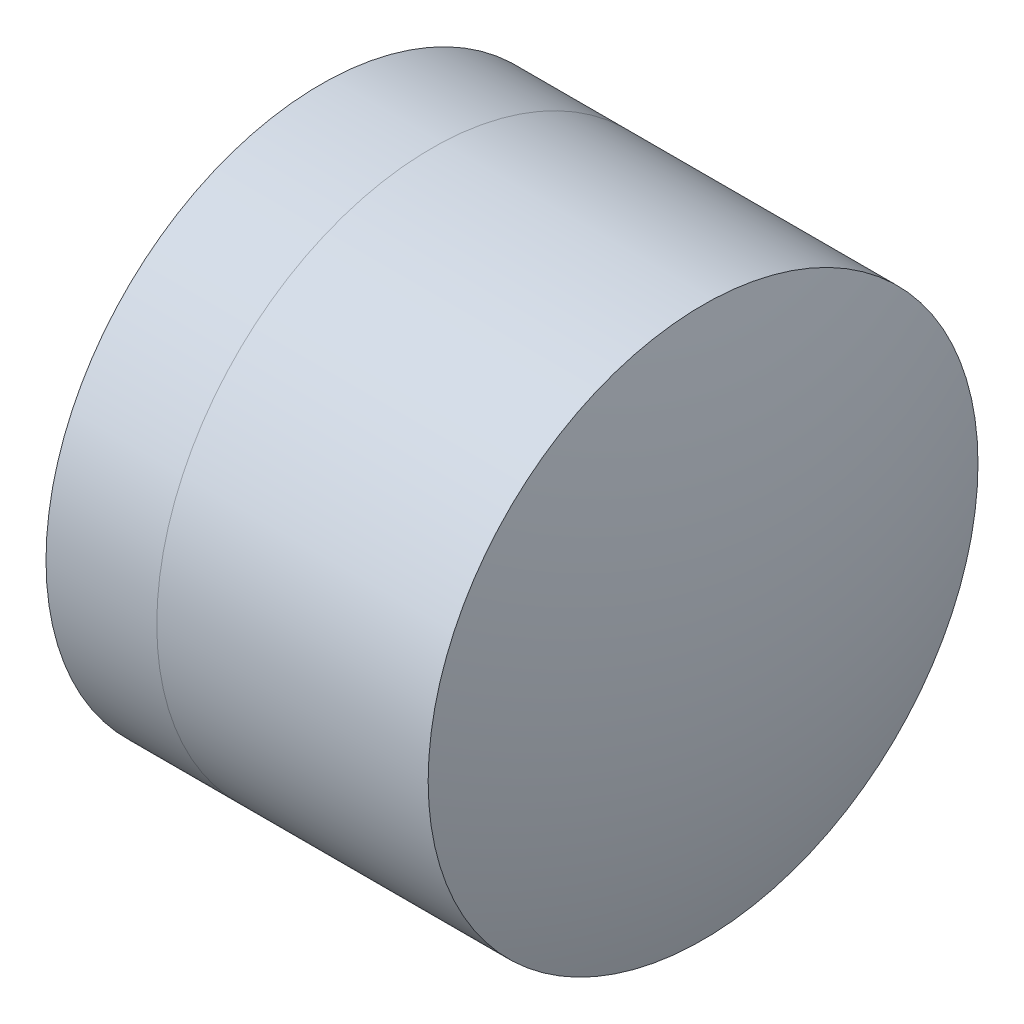
ISO-10303-21;
HEADER;
FILE_DESCRIPTION(('STEP AP214'),'2;1');
FILE_NAME('part.step','',(''),(''),'','','');
FILE_SCHEMA(('AUTOMOTIVE_DESIGN { 1 0 10303 214 1 1 1 1 }'));
ENDSEC;
DATA;
#1=APPLICATION_CONTEXT('core data for automotive mechanical design processes');
#2=APPLICATION_PROTOCOL_DEFINITION('international standard','automotive_design',2000,#1);
#3=PRODUCT_CONTEXT('',#1,'mechanical');
#4=PRODUCT('Part','Part','',(#3));
#5=PRODUCT_RELATED_PRODUCT_CATEGORY('part','',(#4));
#6=PRODUCT_DEFINITION_FORMATION('','',#4);
#7=PRODUCT_DEFINITION_CONTEXT('part definition',#1,'design');
#8=PRODUCT_DEFINITION('design','',#6,#7);
#9=PRODUCT_DEFINITION_SHAPE('','',#8);
#10=(LENGTH_UNIT() NAMED_UNIT(*) SI_UNIT(.MILLI.,.METRE.));
#11=(NAMED_UNIT(*) PLANE_ANGLE_UNIT() SI_UNIT($,.RADIAN.));
#12=(NAMED_UNIT(*) SI_UNIT($,.STERADIAN.) SOLID_ANGLE_UNIT());
#13=UNCERTAINTY_MEASURE_WITH_UNIT(LENGTH_MEASURE(1.E-05),#10,'distance_accuracy_value','');
#14=(GEOMETRIC_REPRESENTATION_CONTEXT(3) GLOBAL_UNCERTAINTY_ASSIGNED_CONTEXT((#13)) GLOBAL_UNIT_ASSIGNED_CONTEXT((#10,
#11,#12)) REPRESENTATION_CONTEXT('',''));
#15=CARTESIAN_POINT('',(0.,0.,0.));
#16=DIRECTION('',(0.,0.,1.));
#17=DIRECTION('',(1.,0.,0.));
#18=AXIS2_PLACEMENT_3D('',#15,#16,#17);
#19=CARTESIAN_POINT('',(0.177965311348842,0.,0.));
#20=DIRECTION('',(-1.,0.,0.));
#21=DIRECTION('',(0.,0.,1.));
#22=AXIS2_PLACEMENT_3D('',#19,#20,#21);
#23=SPHERICAL_SURFACE('',#22,2.665);
#24=CARTESIAN_POINT('',(1.93927874171835,0.,0.));
#25=DIRECTION('',(-1.,0.,0.));
#26=DIRECTION('',(0.,0.,1.));
#27=AXIS2_PLACEMENT_3D('',#24,#25,#26);
#28=CIRCLE('',#27,2.);
#29=CARTESIAN_POINT('',(1.93927874171835,0.,2.));
#30=VERTEX_POINT('',#29);
#31=EDGE_CURVE('E11',#30,#30,#28,.T.);
#32=ORIENTED_EDGE('',*,*,#31,.T.);
#33=EDGE_LOOP('',(#32));
#34=FACE_BOUND('',#33,.T.);
#35=ADVANCED_FACE('F45',(#34),#23,.F.);
#36=CARTESIAN_POINT('',(-0.551919992657797,0.,0.));
#37=DIRECTION('',(-1.,0.,0.));
#38=DIRECTION('',(0.,0.,1.));
#39=AXIS2_PLACEMENT_3D('',#36,#37,#38);
#40=CYLINDRICAL_SURFACE('',#39,2.);
#41=CARTESIAN_POINT('',(3.91343750162891,0.,0.));
#42=DIRECTION('',(-1.,0.,0.));
#43=DIRECTION('',(0.,0.,1.));
#44=AXIS2_PLACEMENT_3D('',#41,#42,#43);
#45=CIRCLE('',#44,2.);
#46=CARTESIAN_POINT('',(3.91343750162891,0.,2.));
#47=VERTEX_POINT('',#46);
#48=EDGE_CURVE('E51',#47,#47,#45,.T.);
#49=ORIENTED_EDGE('',*,*,#48,.T.);
#50=EDGE_LOOP('',(#49));
#51=FACE_BOUND('',#50,.T.);
#52=ORIENTED_EDGE('',*,*,#31,.F.);
#53=EDGE_LOOP('',(#52));
#54=FACE_BOUND('',#53,.T.);
#55=ADVANCED_FACE('F57',(#51,#54),#40,.T.);
#56=CARTESIAN_POINT('',(-2.18603468865116,0.,0.));
#57=DIRECTION('',(-1.,0.,0.));
#58=DIRECTION('',(0.,0.,1.));
#59=AXIS2_PLACEMENT_3D('',#56,#57,#58);
#60=SPHERICAL_SURFACE('',#59,6.419);
#61=ORIENTED_EDGE('',*,*,#48,.F.);
#62=EDGE_LOOP('',(#61));
#63=FACE_BOUND('',#62,.T.);
#64=ADVANCED_FACE('F60',(#63),#60,.T.);
#65=CLOSED_SHELL('',(#35,#55,#64));
#66=MANIFOLD_SOLID_BREP('B2',#65);
#67=CARTESIAN_POINT('',(4.96596531134884,0.,0.));
#68=DIRECTION('',(-1.,0.,0.));
#69=DIRECTION('',(0.,0.,-1.));
#70=AXIS2_PLACEMENT_3D('',#67,#68,#69);
#71=SPHERICAL_SURFACE('',#70,4.323);
#72=CARTESIAN_POINT('',(1.13342972769146,0.,0.));
#73=DIRECTION('',(-1.,0.,0.));
#74=DIRECTION('',(0.,0.,1.));
#75=AXIS2_PLACEMENT_3D('',#72,#73,#74);
#76=CIRCLE('',#75,2.);
#77=CARTESIAN_POINT('',(1.13342972769146,0.,2.));
#78=VERTEX_POINT('',#77);
#79=EDGE_CURVE('E44',#78,#78,#76,.T.);
#80=ORIENTED_EDGE('',*,*,#79,.T.);
#81=EDGE_LOOP('',(#80));
#82=FACE_BOUND('',#81,.T.);
#83=ADVANCED_FACE('F86',(#82),#71,.T.);
#84=CARTESIAN_POINT('',(-0.816062176165804,0.,0.));
#85=DIRECTION('',(-1.,0.,0.));
#86=DIRECTION('',(0.,0.,1.));
#87=AXIS2_PLACEMENT_3D('',#84,#85,#86);
#88=CYLINDRICAL_SURFACE('',#87,2.);
#89=CARTESIAN_POINT('',(1.93927874171835,0.,0.));
#90=DIRECTION('',(-1.,0.,0.));
#91=DIRECTION('',(0.,0.,1.));
#92=AXIS2_PLACEMENT_3D('',#89,#90,#91);
#93=CIRCLE('',#92,2.);
#94=CARTESIAN_POINT('',(1.93927874171835,0.,2.));
#95=VERTEX_POINT('',#94);
#96=EDGE_CURVE('E92',#95,#95,#93,.T.);
#97=ORIENTED_EDGE('',*,*,#96,.T.);
#98=EDGE_LOOP('',(#97));
#99=FACE_BOUND('',#98,.T.);
#100=ORIENTED_EDGE('',*,*,#79,.F.);
#101=EDGE_LOOP('',(#100));
#102=FACE_BOUND('',#101,.T.);
#103=ADVANCED_FACE('F98',(#99,#102),#88,.T.);
#104=CARTESIAN_POINT('',(0.177965311348842,0.,0.));
#105=DIRECTION('',(-1.,0.,0.));
#106=DIRECTION('',(0.,0.,1.));
#107=AXIS2_PLACEMENT_3D('',#104,#105,#106);
#108=SPHERICAL_SURFACE('',#107,2.665);
#109=ORIENTED_EDGE('',*,*,#96,.F.);
#110=EDGE_LOOP('',(#109));
#111=FACE_BOUND('',#110,.T.);
#112=ADVANCED_FACE('F101',(#111),#108,.T.);
#113=CLOSED_SHELL('',(#83,#103,#112));
#114=MANIFOLD_SOLID_BREP('B6',#113);
#115=ADVANCED_BREP_SHAPE_REPRESENTATION('',(#18,#66,#114),#14);
#116=SHAPE_DEFINITION_REPRESENTATION(#9,#115);
ENDSEC;
END-ISO-10303-21;
